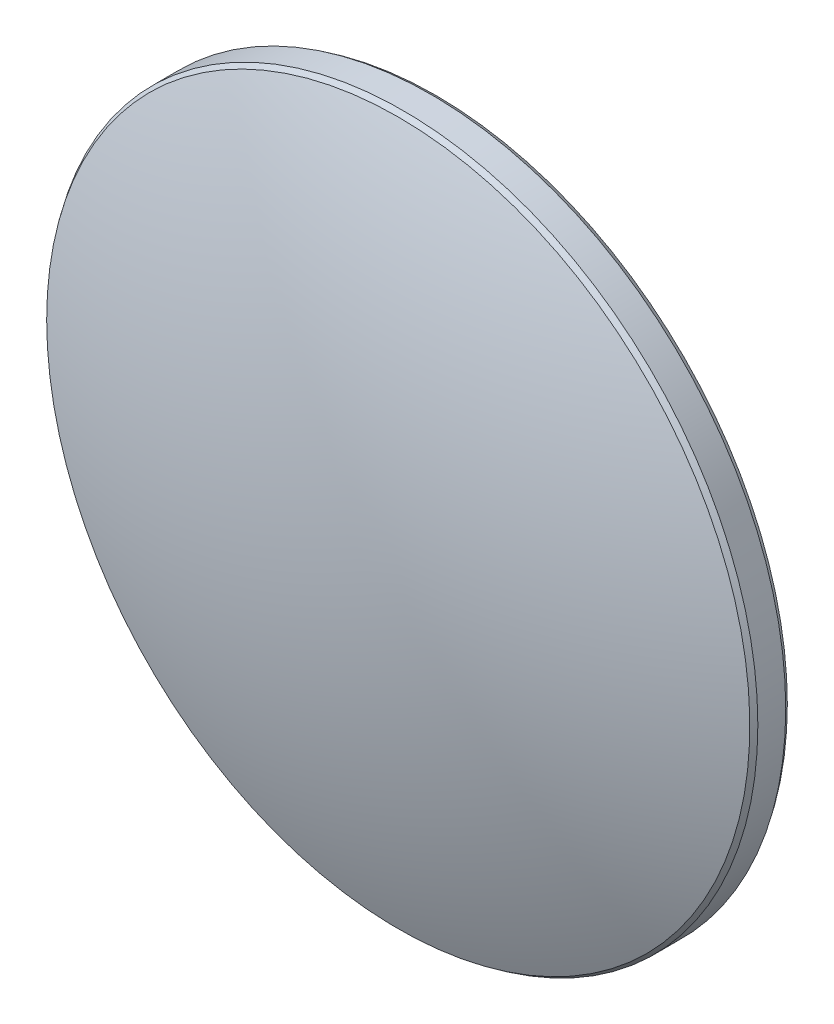
ISO-10303-21;
HEADER;
FILE_DESCRIPTION(('STEP AP214'),'2;1');
FILE_NAME('part.step','',(''),(''),'','','');
FILE_SCHEMA(('AUTOMOTIVE_DESIGN { 1 0 10303 214 1 1 1 1 }'));
ENDSEC;
DATA;
#1=APPLICATION_CONTEXT('core data for automotive mechanical design processes');
#2=APPLICATION_PROTOCOL_DEFINITION('international standard','automotive_design',2000,#1);
#3=PRODUCT_CONTEXT('',#1,'mechanical');
#4=PRODUCT('Part','Part','',(#3));
#5=PRODUCT_RELATED_PRODUCT_CATEGORY('part','',(#4));
#6=PRODUCT_DEFINITION_FORMATION('','',#4);
#7=PRODUCT_DEFINITION_CONTEXT('part definition',#1,'design');
#8=PRODUCT_DEFINITION('design','',#6,#7);
#9=PRODUCT_DEFINITION_SHAPE('','',#8);
#10=(LENGTH_UNIT() NAMED_UNIT(*) SI_UNIT(.MILLI.,.METRE.));
#11=(NAMED_UNIT(*) PLANE_ANGLE_UNIT() SI_UNIT($,.RADIAN.));
#12=(NAMED_UNIT(*) SI_UNIT($,.STERADIAN.) SOLID_ANGLE_UNIT());
#13=UNCERTAINTY_MEASURE_WITH_UNIT(LENGTH_MEASURE(1.E-05),#10,'distance_accuracy_value','');
#14=(GEOMETRIC_REPRESENTATION_CONTEXT(3) GLOBAL_UNCERTAINTY_ASSIGNED_CONTEXT((#13)) GLOBAL_UNIT_ASSIGNED_CONTEXT((#10,
#11,#12)) REPRESENTATION_CONTEXT('',''));
#15=CARTESIAN_POINT('',(0.,0.,0.));
#16=DIRECTION('',(0.,0.,1.));
#17=DIRECTION('',(1.,0.,0.));
#18=AXIS2_PLACEMENT_3D('',#15,#16,#17);
#19=CARTESIAN_POINT('',(0.,0.,-60.75));
#20=DIRECTION('',(0.,0.,1.));
#21=DIRECTION('',(0.,1.,0.));
#22=AXIS2_PLACEMENT_3D('',#19,#20,#21);
#23=SPHERICAL_SURFACE('',#22,67.);
#24=CARTESIAN_POINT('',(0.,0.,1.34279449236024));
#25=DIRECTION('',(0.,0.,-1.));
#26=DIRECTION('',(-1.,0.,0.));
#27=AXIS2_PLACEMENT_3D('',#24,#25,#26);
#28=CIRCLE('',#27,25.1691253747427);
#29=CARTESIAN_POINT('',(-25.1691253747427,0.,1.34279449236024));
#30=VERTEX_POINT('',#29);
#31=EDGE_CURVE('E9',#30,#30,#28,.F.);
#32=ORIENTED_EDGE('',*,*,#31,.T.);
#33=EDGE_LOOP('',(#32));
#34=FACE_BOUND('',#33,.T.);
#35=ADVANCED_FACE('F13',(#34),#23,.T.);
#36=CARTESIAN_POINT('',(0.,0.,6.25));
#37=DIRECTION('',(0.,0.,1.));
#38=DIRECTION('',(1.,0.,0.));
#39=AXIS2_PLACEMENT_3D('',#36,#37,#38);
#40=CYLINDRICAL_SURFACE('',#39,25.4);
#41=CARTESIAN_POINT('',(0.,0.,-0.998709663992181));
#42=DIRECTION('',(0.,0.,1.));
#43=DIRECTION('',(1.,0.,0.));
#44=AXIS2_PLACEMENT_3D('',#41,#42,#43);
#45=CIRCLE('',#44,25.4);
#46=CARTESIAN_POINT('',(25.4,0.,-0.998709663992181));
#47=VERTEX_POINT('',#46);
#48=EDGE_CURVE('E24',#47,#47,#45,.T.);
#49=ORIENTED_EDGE('',*,*,#48,.T.);
#50=EDGE_LOOP('',(#49));
#51=FACE_BOUND('',#50,.T.);
#52=CARTESIAN_POINT('',(0.,0.,0.998709663992181));
#53=DIRECTION('',(0.,0.,-1.));
#54=DIRECTION('',(-1.,0.,0.));
#55=AXIS2_PLACEMENT_3D('',#52,#53,#54);
#56=CIRCLE('',#55,25.4);
#57=CARTESIAN_POINT('',(-25.4,0.,0.998709663992181));
#58=VERTEX_POINT('',#57);
#59=EDGE_CURVE('E28',#58,#58,#56,.T.);
#60=ORIENTED_EDGE('',*,*,#59,.T.);
#61=EDGE_LOOP('',(#60));
#62=FACE_BOUND('',#61,.T.);
#63=ADVANCED_FACE('F34',(#51,#62),#40,.T.);
#64=CARTESIAN_POINT('',(0.,0.,60.75));
#65=DIRECTION('',(0.,0.,1.));
#66=DIRECTION('',(0.,1.,0.));
#67=AXIS2_PLACEMENT_3D('',#64,#65,#66);
#68=SPHERICAL_SURFACE('',#67,67.);
#69=CARTESIAN_POINT('',(0.,0.,-1.34279449236023));
#70=DIRECTION('',(0.,0.,1.));
#71=DIRECTION('',(1.,0.,0.));
#72=AXIS2_PLACEMENT_3D('',#69,#70,#71);
#73=CIRCLE('',#72,25.1691253747427);
#74=CARTESIAN_POINT('',(25.1691253747427,0.,-1.34279449236023));
#75=VERTEX_POINT('',#74);
#76=EDGE_CURVE('E20',#75,#75,#73,.F.);
#77=ORIENTED_EDGE('',*,*,#76,.T.);
#78=EDGE_LOOP('',(#77));
#79=FACE_BOUND('',#78,.T.);
#80=ADVANCED_FACE('F43',(#79),#68,.T.);
#81=CARTESIAN_POINT('',(0.,0.,-0.998709663992181));
#82=DIRECTION('',(0.,0.,1.));
#83=DIRECTION('',(1.,0.,0.));
#84=AXIS2_PLACEMENT_3D('',#81,#82,#83);
#85=CONICAL_SURFACE('',#84,25.4,0.590983992236407);
#86=ORIENTED_EDGE('',*,*,#76,.F.);
#87=EDGE_LOOP('',(#86));
#88=FACE_BOUND('',#87,.T.);
#89=ORIENTED_EDGE('',*,*,#48,.F.);
#90=EDGE_LOOP('',(#89));
#91=FACE_BOUND('',#90,.T.);
#92=ADVANCED_FACE('F38',(#88,#91),#85,.T.);
#93=CARTESIAN_POINT('',(0.,0.,1.34279449236026));
#94=DIRECTION('',(0.,0.,-1.));
#95=DIRECTION('',(-1.,0.,0.));
#96=AXIS2_PLACEMENT_3D('',#93,#94,#95);
#97=CONICAL_SURFACE('',#96,25.1691253747427,0.5909839922364);
#98=ORIENTED_EDGE('',*,*,#59,.F.);
#99=EDGE_LOOP('',(#98));
#100=FACE_BOUND('',#99,.T.);
#101=ORIENTED_EDGE('',*,*,#31,.F.);
#102=EDGE_LOOP('',(#101));
#103=FACE_BOUND('',#102,.T.);
#104=ADVANCED_FACE('F15',(#100,#103),#97,.T.);
#105=CLOSED_SHELL('',(#35,#63,#80,#92,#104));
#106=MANIFOLD_SOLID_BREP('B1',#105);
#107=ADVANCED_BREP_SHAPE_REPRESENTATION('',(#18,#106),#14);
#108=SHAPE_DEFINITION_REPRESENTATION(#9,#107);
ENDSEC;
END-ISO-10303-21;
